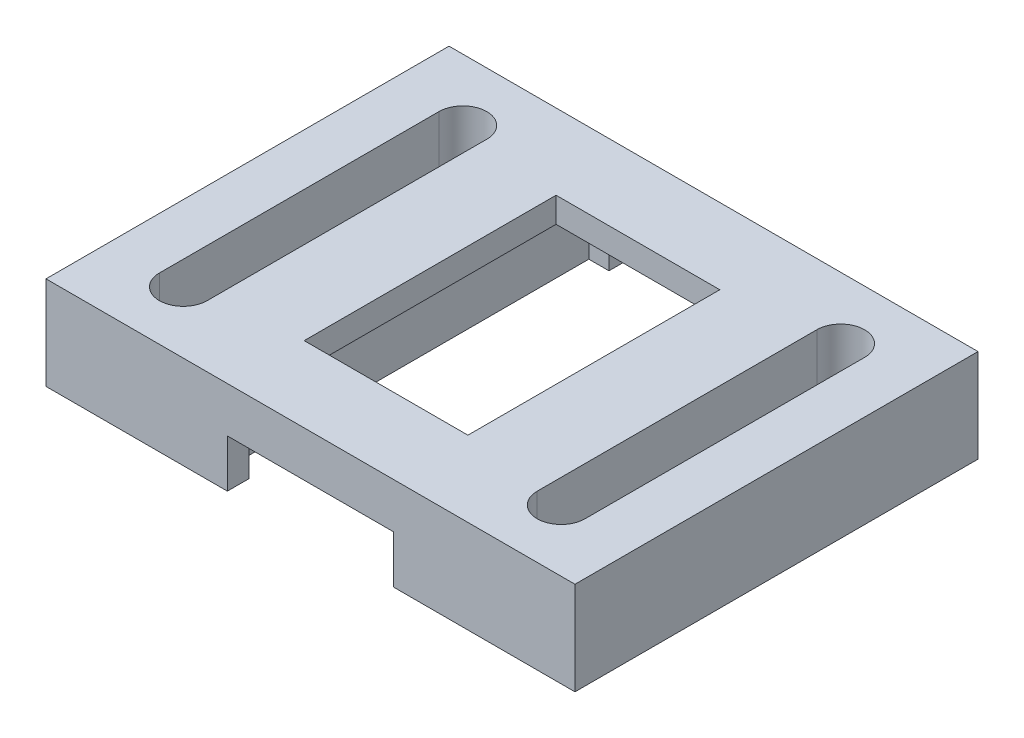
ISO-10303-21;
HEADER;
FILE_DESCRIPTION(('STEP AP214'),'2;1');
FILE_NAME('part.step','',(''),(''),'','','');
FILE_SCHEMA(('AUTOMOTIVE_DESIGN { 1 0 10303 214 1 1 1 1 }'));
ENDSEC;
DATA;
#1=APPLICATION_CONTEXT('core data for automotive mechanical design processes');
#2=APPLICATION_PROTOCOL_DEFINITION('international standard','automotive_design',2000,#1);
#3=PRODUCT_CONTEXT('',#1,'mechanical');
#4=PRODUCT('Part','Part','',(#3));
#5=PRODUCT_RELATED_PRODUCT_CATEGORY('part','',(#4));
#6=PRODUCT_DEFINITION_FORMATION('','',#4);
#7=PRODUCT_DEFINITION_CONTEXT('part definition',#1,'design');
#8=PRODUCT_DEFINITION('design','',#6,#7);
#9=PRODUCT_DEFINITION_SHAPE('','',#8);
#10=(LENGTH_UNIT() NAMED_UNIT(*) SI_UNIT(.MILLI.,.METRE.));
#11=(NAMED_UNIT(*) PLANE_ANGLE_UNIT() SI_UNIT($,.RADIAN.));
#12=(NAMED_UNIT(*) SI_UNIT($,.STERADIAN.) SOLID_ANGLE_UNIT());
#13=UNCERTAINTY_MEASURE_WITH_UNIT(LENGTH_MEASURE(1.E-05),#10,'distance_accuracy_value','');
#14=(GEOMETRIC_REPRESENTATION_CONTEXT(3) GLOBAL_UNCERTAINTY_ASSIGNED_CONTEXT((#13)) GLOBAL_UNIT_ASSIGNED_CONTEXT((#10,
#11,#12)) REPRESENTATION_CONTEXT('',''));
#15=CARTESIAN_POINT('',(0.,0.,0.));
#16=DIRECTION('',(0.,0.,1.));
#17=DIRECTION('',(1.,0.,0.));
#18=AXIS2_PLACEMENT_3D('',#15,#16,#17);
#19=CARTESIAN_POINT('',(0.,0.,0.));
#20=DIRECTION('',(0.,1.,0.));
#21=DIRECTION('',(0.,0.,1.));
#22=AXIS2_PLACEMENT_3D('',#19,#20,#21);
#23=PLANE('',#22);
#24=DIRECTION('',(1.,0.,0.));
#25=VECTOR('',#24,1.);
#26=CARTESIAN_POINT('',(-5.,0.,8.));
#27=LINE('',#26,#25);
#28=CARTESIAN_POINT('',(3.3,0.,8.));
#29=VERTEX_POINT('',#28);
#30=CARTESIAN_POINT('',(10.5,0.,8.));
#31=VERTEX_POINT('',#30);
#32=EDGE_CURVE('E426',#29,#31,#27,.T.);
#33=ORIENTED_EDGE('',*,*,#32,.F.);
#34=DIRECTION('',(0.,0.,1.));
#35=VECTOR('',#34,1.);
#36=CARTESIAN_POINT('',(3.3,0.,-8.));
#37=LINE('',#36,#35);
#38=CARTESIAN_POINT('',(3.3,0.,7.15));
#39=VERTEX_POINT('',#38);
#40=EDGE_CURVE('E345',#39,#29,#37,.T.);
#41=ORIENTED_EDGE('',*,*,#40,.F.);
#42=DIRECTION('',(-1.,0.,0.));
#43=VECTOR('',#42,1.);
#44=CARTESIAN_POINT('',(-4.1,0.,7.15));
#45=LINE('',#44,#43);
#46=CARTESIAN_POINT('',(4.1,0.,7.15));
#47=VERTEX_POINT('',#46);
#48=EDGE_CURVE('E397',#47,#39,#45,.T.);
#49=ORIENTED_EDGE('',*,*,#48,.F.);
#50=DIRECTION('',(0.,0.,1.));
#51=VECTOR('',#50,1.);
#52=CARTESIAN_POINT('',(4.1,0.,-7.15));
#53=LINE('',#52,#51);
#54=CARTESIAN_POINT('',(4.1,0.,-7.15));
#55=VERTEX_POINT('',#54);
#56=EDGE_CURVE('E380',#55,#47,#53,.T.);
#57=ORIENTED_EDGE('',*,*,#56,.F.);
#58=DIRECTION('',(1.,0.,0.));
#59=VECTOR('',#58,1.);
#60=CARTESIAN_POINT('',(-4.1,0.,-7.15));
#61=LINE('',#60,#59);
#62=CARTESIAN_POINT('',(3.3,0.,-7.15));
#63=VERTEX_POINT('',#62);
#64=EDGE_CURVE('E403',#63,#55,#61,.T.);
#65=ORIENTED_EDGE('',*,*,#64,.F.);
#66=CARTESIAN_POINT('',(3.3,0.,-8.));
#67=VERTEX_POINT('',#66);
#68=EDGE_CURVE('E342',#67,#63,#37,.T.);
#69=ORIENTED_EDGE('',*,*,#68,.F.);
#70=DIRECTION('',(-1.,0.,0.));
#71=VECTOR('',#70,1.);
#72=CARTESIAN_POINT('',(-5.,0.,-8.));
#73=LINE('',#72,#71);
#74=CARTESIAN_POINT('',(10.5,0.,-8.));
#75=VERTEX_POINT('',#74);
#76=EDGE_CURVE('E423',#75,#67,#73,.T.);
#77=ORIENTED_EDGE('',*,*,#76,.F.);
#78=DIRECTION('',(0.,0.,-1.));
#79=VECTOR('',#78,1.);
#80=CARTESIAN_POINT('',(10.5,0.,8.));
#81=LINE('',#80,#79);
#82=EDGE_CURVE('E251',#31,#75,#81,.T.);
#83=ORIENTED_EDGE('',*,*,#82,.F.);
#84=EDGE_LOOP('',(#33,#41,#49,#57,#65,#69,#77,#83));
#85=FACE_BOUND('',#84,.T.);
#86=CARTESIAN_POINT('',(7.5,0.,-5.55));
#87=DIRECTION('',(0.,-1.,0.));
#88=DIRECTION('',(0.,0.,1.));
#89=AXIS2_PLACEMENT_3D('',#86,#87,#88);
#90=CIRCLE('',#89,0.95);
#91=CARTESIAN_POINT('',(6.55,0.,-5.55));
#92=VERTEX_POINT('',#91);
#93=CARTESIAN_POINT('',(8.45,0.,-5.55));
#94=VERTEX_POINT('',#93);
#95=EDGE_CURVE('E229',#92,#94,#90,.T.);
#96=ORIENTED_EDGE('',*,*,#95,.F.);
#97=DIRECTION('',(0.,0.,-1.));
#98=VECTOR('',#97,1.);
#99=CARTESIAN_POINT('',(6.55,0.,-5.55));
#100=LINE('',#99,#98);
#101=CARTESIAN_POINT('',(6.55,0.,5.55));
#102=VERTEX_POINT('',#101);
#103=EDGE_CURVE('E221',#102,#92,#100,.T.);
#104=ORIENTED_EDGE('',*,*,#103,.F.);
#105=CARTESIAN_POINT('',(7.5,0.,5.55));
#106=DIRECTION('',(0.,-1.,0.));
#107=DIRECTION('',(0.,0.,1.));
#108=AXIS2_PLACEMENT_3D('',#105,#106,#107);
#109=CIRCLE('',#108,0.95);
#110=CARTESIAN_POINT('',(8.45,0.,5.55));
#111=VERTEX_POINT('',#110);
#112=EDGE_CURVE('E228',#111,#102,#109,.T.);
#113=ORIENTED_EDGE('',*,*,#112,.F.);
#114=DIRECTION('',(0.,0.,1.));
#115=VECTOR('',#114,1.);
#116=CARTESIAN_POINT('',(8.45,0.,-5.55));
#117=LINE('',#116,#115);
#118=EDGE_CURVE('E233',#94,#111,#117,.T.);
#119=ORIENTED_EDGE('',*,*,#118,.F.);
#120=EDGE_LOOP('',(#96,#104,#113,#119));
#121=FACE_BOUND('',#120,.T.);
#122=ADVANCED_FACE('F36',(#85,#121),#23,.F.);
#123=CARTESIAN_POINT('',(0.,3.7,0.));
#124=DIRECTION('',(0.,1.,0.));
#125=DIRECTION('',(0.,0.,1.));
#126=AXIS2_PLACEMENT_3D('',#123,#124,#125);
#127=PLANE('',#126);
#128=CARTESIAN_POINT('',(-7.5,3.7,-5.55));
#129=DIRECTION('',(0.,1.,0.));
#130=DIRECTION('',(0.,0.,1.));
#131=AXIS2_PLACEMENT_3D('',#128,#129,#130);
#132=CIRCLE('',#131,0.95);
#133=CARTESIAN_POINT('',(-6.55,3.7,-5.55));
#134=VERTEX_POINT('',#133);
#135=CARTESIAN_POINT('',(-8.45,3.7,-5.55));
#136=VERTEX_POINT('',#135);
#137=EDGE_CURVE('E264',#134,#136,#132,.T.);
#138=ORIENTED_EDGE('',*,*,#137,.F.);
#139=DIRECTION('',(0.,0.,-1.));
#140=VECTOR('',#139,1.);
#141=CARTESIAN_POINT('',(-6.55,3.7,-5.55));
#142=LINE('',#141,#140);
#143=CARTESIAN_POINT('',(-6.55,3.7,5.55));
#144=VERTEX_POINT('',#143);
#145=EDGE_CURVE('E271',#144,#134,#142,.T.);
#146=ORIENTED_EDGE('',*,*,#145,.F.);
#147=CARTESIAN_POINT('',(-7.5,3.7,5.55));
#148=DIRECTION('',(0.,1.,0.));
#149=DIRECTION('',(0.,0.,1.));
#150=AXIS2_PLACEMENT_3D('',#147,#148,#149);
#151=CIRCLE('',#150,0.95);
#152=CARTESIAN_POINT('',(-8.45,3.7,5.55));
#153=VERTEX_POINT('',#152);
#154=EDGE_CURVE('E285',#153,#144,#151,.T.);
#155=ORIENTED_EDGE('',*,*,#154,.F.);
#156=DIRECTION('',(0.,0.,1.));
#157=VECTOR('',#156,1.);
#158=CARTESIAN_POINT('',(-8.45,3.7,-5.55));
#159=LINE('',#158,#157);
#160=EDGE_CURVE('E282',#136,#153,#159,.T.);
#161=ORIENTED_EDGE('',*,*,#160,.F.);
#162=EDGE_LOOP('',(#138,#146,#155,#161));
#163=FACE_BOUND('',#162,.T.);
#164=DIRECTION('',(0.,0.,-1.));
#165=VECTOR('',#164,1.);
#166=CARTESIAN_POINT('',(3.25,3.7,5.));
#167=LINE('',#166,#165);
#168=CARTESIAN_POINT('',(3.25,3.7,5.));
#169=VERTEX_POINT('',#168);
#170=CARTESIAN_POINT('',(3.25,3.7,-5.));
#171=VERTEX_POINT('',#170);
#172=EDGE_CURVE('E318',#169,#171,#167,.T.);
#173=ORIENTED_EDGE('',*,*,#172,.F.);
#174=DIRECTION('',(1.,0.,0.));
#175=VECTOR('',#174,1.);
#176=CARTESIAN_POINT('',(-3.25,3.7,5.));
#177=LINE('',#176,#175);
#178=CARTESIAN_POINT('',(-3.25,3.7,5.));
#179=VERTEX_POINT('',#178);
#180=EDGE_CURVE('E326',#179,#169,#177,.T.);
#181=ORIENTED_EDGE('',*,*,#180,.F.);
#182=DIRECTION('',(0.,0.,1.));
#183=VECTOR('',#182,1.);
#184=CARTESIAN_POINT('',(-3.25,3.7,5.));
#185=LINE('',#184,#183);
#186=CARTESIAN_POINT('',(-3.25,3.7,-5.));
#187=VERTEX_POINT('',#186);
#188=EDGE_CURVE('E323',#187,#179,#185,.T.);
#189=ORIENTED_EDGE('',*,*,#188,.F.);
#190=DIRECTION('',(-1.,0.,0.));
#191=VECTOR('',#190,1.);
#192=CARTESIAN_POINT('',(-3.25,3.7,-5.));
#193=LINE('',#192,#191);
#194=EDGE_CURVE('E320',#171,#187,#193,.T.);
#195=ORIENTED_EDGE('',*,*,#194,.F.);
#196=EDGE_LOOP('',(#173,#181,#189,#195));
#197=FACE_BOUND('',#196,.T.);
#198=DIRECTION('',(1.,0.,0.));
#199=VECTOR('',#198,1.);
#200=CARTESIAN_POINT('',(-5.,3.7,8.));
#201=LINE('',#200,#199);
#202=CARTESIAN_POINT('',(-10.5,3.7,8.));
#203=VERTEX_POINT('',#202);
#204=CARTESIAN_POINT('',(10.5,3.7,8.));
#205=VERTEX_POINT('',#204);
#206=EDGE_CURVE('E419',#203,#205,#201,.T.);
#207=ORIENTED_EDGE('',*,*,#206,.T.);
#208=DIRECTION('',(0.,0.,-1.));
#209=VECTOR('',#208,1.);
#210=CARTESIAN_POINT('',(10.5,3.7,8.));
#211=LINE('',#210,#209);
#212=CARTESIAN_POINT('',(10.5,3.7,-8.));
#213=VERTEX_POINT('',#212);
#214=EDGE_CURVE('E255',#205,#213,#211,.T.);
#215=ORIENTED_EDGE('',*,*,#214,.T.);
#216=DIRECTION('',(-1.,0.,0.));
#217=VECTOR('',#216,1.);
#218=CARTESIAN_POINT('',(-5.,3.7,-8.));
#219=LINE('',#218,#217);
#220=CARTESIAN_POINT('',(-10.5,3.7,-8.));
#221=VERTEX_POINT('',#220);
#222=EDGE_CURVE('E417',#213,#221,#219,.T.);
#223=ORIENTED_EDGE('',*,*,#222,.T.);
#224=DIRECTION('',(0.,0.,-1.));
#225=VECTOR('',#224,1.);
#226=CARTESIAN_POINT('',(-10.5,3.7,8.));
#227=LINE('',#226,#225);
#228=EDGE_CURVE('E299',#203,#221,#227,.T.);
#229=ORIENTED_EDGE('',*,*,#228,.F.);
#230=EDGE_LOOP('',(#207,#215,#223,#229));
#231=FACE_BOUND('',#230,.T.);
#232=DIRECTION('',(0.,0.,-1.));
#233=VECTOR('',#232,1.);
#234=CARTESIAN_POINT('',(6.55,3.7,-5.55));
#235=LINE('',#234,#233);
#236=CARTESIAN_POINT('',(6.55,3.7,5.55));
#237=VERTEX_POINT('',#236);
#238=CARTESIAN_POINT('',(6.55,3.7,-5.55));
#239=VERTEX_POINT('',#238);
#240=EDGE_CURVE('E245',#237,#239,#235,.T.);
#241=ORIENTED_EDGE('',*,*,#240,.T.);
#242=CARTESIAN_POINT('',(7.5,3.7,-5.55));
#243=DIRECTION('',(0.,-1.,0.));
#244=DIRECTION('',(0.,0.,1.));
#245=AXIS2_PLACEMENT_3D('',#242,#243,#244);
#246=CIRCLE('',#245,0.95);
#247=CARTESIAN_POINT('',(8.45,3.7,-5.55));
#248=VERTEX_POINT('',#247);
#249=EDGE_CURVE('E59',#239,#248,#246,.T.);
#250=ORIENTED_EDGE('',*,*,#249,.T.);
#251=DIRECTION('',(0.,0.,1.));
#252=VECTOR('',#251,1.);
#253=CARTESIAN_POINT('',(8.45,3.7,-5.55));
#254=LINE('',#253,#252);
#255=CARTESIAN_POINT('',(8.45,3.7,5.55));
#256=VERTEX_POINT('',#255);
#257=EDGE_CURVE('E236',#248,#256,#254,.T.);
#258=ORIENTED_EDGE('',*,*,#257,.T.);
#259=CARTESIAN_POINT('',(7.5,3.7,5.55));
#260=DIRECTION('',(0.,-1.,0.));
#261=DIRECTION('',(0.,0.,1.));
#262=AXIS2_PLACEMENT_3D('',#259,#260,#261);
#263=CIRCLE('',#262,0.95);
#264=EDGE_CURVE('E239',#256,#237,#263,.T.);
#265=ORIENTED_EDGE('',*,*,#264,.T.);
#266=EDGE_LOOP('',(#241,#250,#258,#265));
#267=FACE_BOUND('',#266,.T.);
#268=ADVANCED_FACE('F475',(#163,#197,#231,#267),#127,.T.);
#269=CARTESIAN_POINT('',(0.,2.7,0.));
#270=DIRECTION('',(0.,1.,0.));
#271=DIRECTION('',(0.,0.,1.));
#272=AXIS2_PLACEMENT_3D('',#269,#270,#271);
#273=PLANE('',#272);
#274=DIRECTION('',(0.,0.,1.));
#275=VECTOR('',#274,1.);
#276=CARTESIAN_POINT('',(4.1,2.7,-7.15));
#277=LINE('',#276,#275);
#278=CARTESIAN_POINT('',(4.1,2.7,-7.15));
#279=VERTEX_POINT('',#278);
#280=CARTESIAN_POINT('',(4.1,2.7,7.15));
#281=VERTEX_POINT('',#280);
#282=EDGE_CURVE('E381',#279,#281,#277,.T.);
#283=ORIENTED_EDGE('',*,*,#282,.T.);
#284=DIRECTION('',(-1.,0.,0.));
#285=VECTOR('',#284,1.);
#286=CARTESIAN_POINT('',(-4.1,2.7,7.15));
#287=LINE('',#286,#285);
#288=CARTESIAN_POINT('',(-4.1,2.7,7.15));
#289=VERTEX_POINT('',#288);
#290=EDGE_CURVE('E384',#281,#289,#287,.T.);
#291=ORIENTED_EDGE('',*,*,#290,.T.);
#292=DIRECTION('',(0.,0.,-1.));
#293=VECTOR('',#292,1.);
#294=CARTESIAN_POINT('',(-4.1,2.7,-7.15));
#295=LINE('',#294,#293);
#296=CARTESIAN_POINT('',(-4.1,2.7,-7.15));
#297=VERTEX_POINT('',#296);
#298=EDGE_CURVE('E388',#289,#297,#295,.T.);
#299=ORIENTED_EDGE('',*,*,#298,.T.);
#300=DIRECTION('',(1.,0.,0.));
#301=VECTOR('',#300,1.);
#302=CARTESIAN_POINT('',(-4.1,2.7,-7.15));
#303=LINE('',#302,#301);
#304=EDGE_CURVE('E391',#297,#279,#303,.T.);
#305=ORIENTED_EDGE('',*,*,#304,.T.);
#306=EDGE_LOOP('',(#283,#291,#299,#305));
#307=FACE_BOUND('',#306,.T.);
#308=DIRECTION('',(1.,0.,0.));
#309=VECTOR('',#308,1.);
#310=CARTESIAN_POINT('',(-3.25,2.7,-5.));
#311=LINE('',#310,#309);
#312=CARTESIAN_POINT('',(-3.25,2.7,-5.));
#313=VERTEX_POINT('',#312);
#314=CARTESIAN_POINT('',(3.25,2.7,-5.));
#315=VERTEX_POINT('',#314);
#316=EDGE_CURVE('E332',#313,#315,#311,.T.);
#317=ORIENTED_EDGE('',*,*,#316,.F.);
#318=DIRECTION('',(0.,0.,-1.));
#319=VECTOR('',#318,1.);
#320=CARTESIAN_POINT('',(-3.25,2.7,5.));
#321=LINE('',#320,#319);
#322=CARTESIAN_POINT('',(-3.25,2.7,5.));
#323=VERTEX_POINT('',#322);
#324=EDGE_CURVE('E308',#323,#313,#321,.T.);
#325=ORIENTED_EDGE('',*,*,#324,.F.);
#326=DIRECTION('',(-1.,0.,0.));
#327=VECTOR('',#326,1.);
#328=CARTESIAN_POINT('',(-3.25,2.7,5.));
#329=LINE('',#328,#327);
#330=CARTESIAN_POINT('',(3.25,2.7,5.));
#331=VERTEX_POINT('',#330);
#332=EDGE_CURVE('E313',#331,#323,#329,.T.);
#333=ORIENTED_EDGE('',*,*,#332,.F.);
#334=DIRECTION('',(0.,0.,1.));
#335=VECTOR('',#334,1.);
#336=CARTESIAN_POINT('',(3.25,2.7,5.));
#337=LINE('',#336,#335);
#338=EDGE_CURVE('E315',#315,#331,#337,.T.);
#339=ORIENTED_EDGE('',*,*,#338,.F.);
#340=EDGE_LOOP('',(#317,#325,#333,#339));
#341=FACE_BOUND('',#340,.T.);
#342=ADVANCED_FACE('F460',(#307,#341),#273,.F.);
#343=CARTESIAN_POINT('',(-5.,3.7,-8.));
#344=DIRECTION('',(0.,0.,1.));
#345=DIRECTION('',(1.,0.,0.));
#346=AXIS2_PLACEMENT_3D('',#343,#344,#345);
#347=PLANE('',#346);
#348=ORIENTED_EDGE('',*,*,#76,.T.);
#349=DIRECTION('',(0.,-1.,0.));
#350=VECTOR('',#349,1.);
#351=CARTESIAN_POINT('',(3.3,20.0078017090559,-8.));
#352=LINE('',#351,#350);
#353=CARTESIAN_POINT('',(3.3,1.9,-8.));
#354=VERTEX_POINT('',#353);
#355=EDGE_CURVE('E350',#354,#67,#352,.T.);
#356=ORIENTED_EDGE('',*,*,#355,.F.);
#357=DIRECTION('',(1.,0.,0.));
#358=VECTOR('',#357,1.);
#359=CARTESIAN_POINT('',(3.3,1.9,-8.));
#360=LINE('',#359,#358);
#361=CARTESIAN_POINT('',(-3.3,1.9,-8.));
#362=VERTEX_POINT('',#361);
#363=EDGE_CURVE('E344',#362,#354,#360,.T.);
#364=ORIENTED_EDGE('',*,*,#363,.F.);
#365=DIRECTION('',(0.,-1.,0.));
#366=VECTOR('',#365,1.);
#367=CARTESIAN_POINT('',(-3.3,20.0078017090559,-8.));
#368=LINE('',#367,#366);
#369=CARTESIAN_POINT('',(-3.3,0.,-8.));
#370=VERTEX_POINT('',#369);
#371=EDGE_CURVE('E354',#362,#370,#368,.T.);
#372=ORIENTED_EDGE('',*,*,#371,.T.);
#373=CARTESIAN_POINT('',(-10.5,0.,-8.));
#374=VERTEX_POINT('',#373);
#375=EDGE_CURVE('E409',#370,#374,#73,.T.);
#376=ORIENTED_EDGE('',*,*,#375,.T.);
#377=DIRECTION('',(0.,-1.,0.));
#378=VECTOR('',#377,1.);
#379=CARTESIAN_POINT('',(-10.5,3.7,-8.));
#380=LINE('',#379,#378);
#381=EDGE_CURVE('E302',#221,#374,#380,.T.);
#382=ORIENTED_EDGE('',*,*,#381,.F.);
#383=ORIENTED_EDGE('',*,*,#222,.F.);
#384=DIRECTION('',(0.,-1.,0.));
#385=VECTOR('',#384,1.);
#386=CARTESIAN_POINT('',(10.5,3.7,-8.));
#387=LINE('',#386,#385);
#388=EDGE_CURVE('E261',#213,#75,#387,.T.);
#389=ORIENTED_EDGE('',*,*,#388,.T.);
#390=EDGE_LOOP('',(#348,#356,#364,#372,#376,#382,#383,#389));
#391=FACE_BOUND('',#390,.T.);
#392=ADVANCED_FACE('F38',(#391),#347,.F.);
#393=CARTESIAN_POINT('',(-5.,3.7,8.));
#394=DIRECTION('',(0.,0.,-1.));
#395=DIRECTION('',(-1.,0.,0.));
#396=AXIS2_PLACEMENT_3D('',#393,#394,#395);
#397=PLANE('',#396);
#398=DIRECTION('',(-1.,0.,0.));
#399=VECTOR('',#398,1.);
#400=CARTESIAN_POINT('',(3.3,1.9,8.));
#401=LINE('',#400,#399);
#402=CARTESIAN_POINT('',(3.3,1.9,7.99999999999999));
#403=VERTEX_POINT('',#402);
#404=CARTESIAN_POINT('',(-3.3,1.9,8.));
#405=VERTEX_POINT('',#404);
#406=EDGE_CURVE('E356',#403,#405,#401,.T.);
#407=ORIENTED_EDGE('',*,*,#406,.F.);
#408=DIRECTION('',(0.,-1.,0.));
#409=VECTOR('',#408,1.);
#410=CARTESIAN_POINT('',(3.3,20.0078017090559,8.));
#411=LINE('',#410,#409);
#412=EDGE_CURVE('E360',#403,#29,#411,.T.);
#413=ORIENTED_EDGE('',*,*,#412,.T.);
#414=ORIENTED_EDGE('',*,*,#32,.T.);
#415=DIRECTION('',(0.,-1.,0.));
#416=VECTOR('',#415,1.);
#417=CARTESIAN_POINT('',(10.5,3.7,8.));
#418=LINE('',#417,#416);
#419=EDGE_CURVE('E258',#205,#31,#418,.T.);
#420=ORIENTED_EDGE('',*,*,#419,.F.);
#421=ORIENTED_EDGE('',*,*,#206,.F.);
#422=DIRECTION('',(0.,-1.,0.));
#423=VECTOR('',#422,1.);
#424=CARTESIAN_POINT('',(-10.5,3.7,8.));
#425=LINE('',#424,#423);
#426=CARTESIAN_POINT('',(-10.5,0.,8.));
#427=VERTEX_POINT('',#426);
#428=EDGE_CURVE('E305',#203,#427,#425,.T.);
#429=ORIENTED_EDGE('',*,*,#428,.T.);
#430=CARTESIAN_POINT('',(-3.3,0.,8.));
#431=VERTEX_POINT('',#430);
#432=EDGE_CURVE('E420',#427,#431,#27,.T.);
#433=ORIENTED_EDGE('',*,*,#432,.T.);
#434=DIRECTION('',(0.,-1.,0.));
#435=VECTOR('',#434,1.);
#436=CARTESIAN_POINT('',(-3.3,20.0078017090559,8.));
#437=LINE('',#436,#435);
#438=EDGE_CURVE('E359',#405,#431,#437,.T.);
#439=ORIENTED_EDGE('',*,*,#438,.F.);
#440=EDGE_LOOP('',(#407,#413,#414,#420,#421,#429,#433,#439));
#441=FACE_BOUND('',#440,.T.);
#442=ADVANCED_FACE('F445',(#441),#397,.F.);
#443=DIRECTION('',(0.,0.,-1.));
#444=VECTOR('',#443,1.);
#445=CARTESIAN_POINT('',(-6.55,0.,-5.55));
#446=LINE('',#445,#444);
#447=CARTESIAN_POINT('',(-6.55,0.,5.55));
#448=VERTEX_POINT('',#447);
#449=CARTESIAN_POINT('',(-6.55,0.,-5.55));
#450=VERTEX_POINT('',#449);
#451=EDGE_CURVE('E277',#448,#450,#446,.T.);
#452=ORIENTED_EDGE('',*,*,#451,.T.);
#453=CARTESIAN_POINT('',(-7.5,0.,-5.55));
#454=DIRECTION('',(0.,1.,0.));
#455=DIRECTION('',(0.,0.,1.));
#456=AXIS2_PLACEMENT_3D('',#453,#454,#455);
#457=CIRCLE('',#456,0.95);
#458=CARTESIAN_POINT('',(-8.45,0.,-5.55));
#459=VERTEX_POINT('',#458);
#460=EDGE_CURVE('E267',#450,#459,#457,.T.);
#461=ORIENTED_EDGE('',*,*,#460,.T.);
#462=DIRECTION('',(0.,0.,1.));
#463=VECTOR('',#462,1.);
#464=CARTESIAN_POINT('',(-8.45,0.,-5.55));
#465=LINE('',#464,#463);
#466=CARTESIAN_POINT('',(-8.45,0.,5.55));
#467=VERTEX_POINT('',#466);
#468=EDGE_CURVE('E270',#459,#467,#465,.T.);
#469=ORIENTED_EDGE('',*,*,#468,.T.);
#470=CARTESIAN_POINT('',(-7.5,0.,5.55));
#471=DIRECTION('',(0.,1.,0.));
#472=DIRECTION('',(0.,0.,1.));
#473=AXIS2_PLACEMENT_3D('',#470,#471,#472);
#474=CIRCLE('',#473,0.95);
#475=EDGE_CURVE('E274',#467,#448,#474,.T.);
#476=ORIENTED_EDGE('',*,*,#475,.T.);
#477=EDGE_LOOP('',(#452,#461,#469,#476));
#478=FACE_BOUND('',#477,.T.);
#479=ORIENTED_EDGE('',*,*,#375,.F.);
#480=DIRECTION('',(0.,0.,-1.));
#481=VECTOR('',#480,1.);
#482=CARTESIAN_POINT('',(-3.3,0.,-8.));
#483=LINE('',#482,#481);
#484=CARTESIAN_POINT('',(-3.3,0.,-7.15));
#485=VERTEX_POINT('',#484);
#486=EDGE_CURVE('E341',#485,#370,#483,.T.);
#487=ORIENTED_EDGE('',*,*,#486,.F.);
#488=CARTESIAN_POINT('',(-4.1,0.,-7.15));
#489=VERTEX_POINT('',#488);
#490=EDGE_CURVE('E385',#489,#485,#61,.T.);
#491=ORIENTED_EDGE('',*,*,#490,.F.);
#492=DIRECTION('',(0.,0.,-1.));
#493=VECTOR('',#492,1.);
#494=CARTESIAN_POINT('',(-4.1,0.,-7.15));
#495=LINE('',#494,#493);
#496=CARTESIAN_POINT('',(-4.1,0.,7.15));
#497=VERTEX_POINT('',#496);
#498=EDGE_CURVE('E400',#497,#489,#495,.T.);
#499=ORIENTED_EDGE('',*,*,#498,.F.);
#500=CARTESIAN_POINT('',(-3.3,0.,7.15));
#501=VERTEX_POINT('',#500);
#502=EDGE_CURVE('E396',#501,#497,#45,.T.);
#503=ORIENTED_EDGE('',*,*,#502,.F.);
#504=EDGE_CURVE('E346',#431,#501,#483,.T.);
#505=ORIENTED_EDGE('',*,*,#504,.F.);
#506=ORIENTED_EDGE('',*,*,#432,.F.);
#507=DIRECTION('',(0.,0.,-1.));
#508=VECTOR('',#507,1.);
#509=CARTESIAN_POINT('',(-10.5,0.,8.));
#510=LINE('',#509,#508);
#511=EDGE_CURVE('E292',#427,#374,#510,.T.);
#512=ORIENTED_EDGE('',*,*,#511,.T.);
#513=EDGE_LOOP('',(#479,#487,#491,#499,#503,#505,#506,#512));
#514=FACE_BOUND('',#513,.T.);
#515=ADVANCED_FACE('F451',(#478,#514),#23,.F.);
#516=CARTESIAN_POINT('',(4.1,2.7,-7.15));
#517=DIRECTION('',(1.,0.,0.));
#518=DIRECTION('',(0.,0.,-1.));
#519=AXIS2_PLACEMENT_3D('',#516,#517,#518);
#520=PLANE('',#519);
#521=ORIENTED_EDGE('',*,*,#56,.T.);
#522=DIRECTION('',(0.,-1.,0.));
#523=VECTOR('',#522,1.);
#524=CARTESIAN_POINT('',(4.1,2.7,7.15));
#525=LINE('',#524,#523);
#526=EDGE_CURVE('E394',#281,#47,#525,.T.);
#527=ORIENTED_EDGE('',*,*,#526,.F.);
#528=ORIENTED_EDGE('',*,*,#282,.F.);
#529=DIRECTION('',(0.,-1.,0.));
#530=VECTOR('',#529,1.);
#531=CARTESIAN_POINT('',(4.1,2.7,-7.15));
#532=LINE('',#531,#530);
#533=EDGE_CURVE('E406',#279,#55,#532,.T.);
#534=ORIENTED_EDGE('',*,*,#533,.T.);
#535=EDGE_LOOP('',(#521,#527,#528,#534));
#536=FACE_BOUND('',#535,.T.);
#537=ADVANCED_FACE('F493',(#536),#520,.F.);
#538=CARTESIAN_POINT('',(-4.1,2.7,-7.15));
#539=DIRECTION('',(0.,0.,-1.));
#540=DIRECTION('',(-1.,0.,0.));
#541=AXIS2_PLACEMENT_3D('',#538,#539,#540);
#542=PLANE('',#541);
#543=DIRECTION('',(1.,0.,0.));
#544=VECTOR('',#543,1.);
#545=CARTESIAN_POINT('',(-4.1,1.9,-7.15));
#546=LINE('',#545,#544);
#547=CARTESIAN_POINT('',(-3.3,1.9,-7.15));
#548=VERTEX_POINT('',#547);
#549=CARTESIAN_POINT('',(3.3,1.9,-7.15));
#550=VERTEX_POINT('',#549);
#551=EDGE_CURVE('E377',#548,#550,#546,.T.);
#552=ORIENTED_EDGE('',*,*,#551,.T.);
#553=DIRECTION('',(0.,-1.,0.));
#554=VECTOR('',#553,1.);
#555=CARTESIAN_POINT('',(3.3,2.7,-7.15));
#556=LINE('',#555,#554);
#557=EDGE_CURVE('E374',#550,#63,#556,.T.);
#558=ORIENTED_EDGE('',*,*,#557,.T.);
#559=ORIENTED_EDGE('',*,*,#64,.T.);
#560=ORIENTED_EDGE('',*,*,#533,.F.);
#561=ORIENTED_EDGE('',*,*,#304,.F.);
#562=DIRECTION('',(0.,-1.,0.));
#563=VECTOR('',#562,1.);
#564=CARTESIAN_POINT('',(-4.1,2.7,-7.15));
#565=LINE('',#564,#563);
#566=EDGE_CURVE('E410',#297,#489,#565,.T.);
#567=ORIENTED_EDGE('',*,*,#566,.T.);
#568=ORIENTED_EDGE('',*,*,#490,.T.);
#569=DIRECTION('',(0.,1.,0.));
#570=VECTOR('',#569,1.);
#571=CARTESIAN_POINT('',(-3.3,2.7,-7.15));
#572=LINE('',#571,#570);
#573=EDGE_CURVE('E371',#485,#548,#572,.T.);
#574=ORIENTED_EDGE('',*,*,#573,.T.);
#575=EDGE_LOOP('',(#552,#558,#559,#560,#561,#567,#568,#574));
#576=FACE_BOUND('',#575,.T.);
#577=ADVANCED_FACE('F492',(#576),#542,.F.);
#578=CARTESIAN_POINT('',(-4.1,2.7,-7.15));
#579=DIRECTION('',(-1.,0.,0.));
#580=DIRECTION('',(0.,0.,1.));
#581=AXIS2_PLACEMENT_3D('',#578,#579,#580);
#582=PLANE('',#581);
#583=ORIENTED_EDGE('',*,*,#498,.T.);
#584=ORIENTED_EDGE('',*,*,#566,.F.);
#585=ORIENTED_EDGE('',*,*,#298,.F.);
#586=DIRECTION('',(0.,-1.,0.));
#587=VECTOR('',#586,1.);
#588=CARTESIAN_POINT('',(-4.1,2.7,7.15));
#589=LINE('',#588,#587);
#590=EDGE_CURVE('E412',#289,#497,#589,.T.);
#591=ORIENTED_EDGE('',*,*,#590,.T.);
#592=EDGE_LOOP('',(#583,#584,#585,#591));
#593=FACE_BOUND('',#592,.T.);
#594=ADVANCED_FACE('F457',(#593),#582,.F.);
#595=CARTESIAN_POINT('',(-4.1,2.7,7.15));
#596=DIRECTION('',(0.,0.,1.));
#597=DIRECTION('',(1.,0.,0.));
#598=AXIS2_PLACEMENT_3D('',#595,#596,#597);
#599=PLANE('',#598);
#600=ORIENTED_EDGE('',*,*,#48,.T.);
#601=DIRECTION('',(0.,1.,0.));
#602=VECTOR('',#601,1.);
#603=CARTESIAN_POINT('',(3.3,2.7,7.15));
#604=LINE('',#603,#602);
#605=CARTESIAN_POINT('',(3.3,1.9,7.15));
#606=VERTEX_POINT('',#605);
#607=EDGE_CURVE('E13',#39,#606,#604,.T.);
#608=ORIENTED_EDGE('',*,*,#607,.T.);
#609=DIRECTION('',(-1.,0.,0.));
#610=VECTOR('',#609,1.);
#611=CARTESIAN_POINT('',(-4.1,1.9,7.15));
#612=LINE('',#611,#610);
#613=CARTESIAN_POINT('',(-3.3,1.9,7.15));
#614=VERTEX_POINT('',#613);
#615=EDGE_CURVE('E44',#606,#614,#612,.T.);
#616=ORIENTED_EDGE('',*,*,#615,.T.);
#617=DIRECTION('',(0.,-1.,0.));
#618=VECTOR('',#617,1.);
#619=CARTESIAN_POINT('',(-3.3,2.7,7.15));
#620=LINE('',#619,#618);
#621=EDGE_CURVE('E422',#614,#501,#620,.T.);
#622=ORIENTED_EDGE('',*,*,#621,.T.);
#623=ORIENTED_EDGE('',*,*,#502,.T.);
#624=ORIENTED_EDGE('',*,*,#590,.F.);
#625=ORIENTED_EDGE('',*,*,#290,.F.);
#626=ORIENTED_EDGE('',*,*,#526,.T.);
#627=EDGE_LOOP('',(#600,#608,#616,#622,#623,#624,#625,#626));
#628=FACE_BOUND('',#627,.T.);
#629=ADVANCED_FACE('F432',(#628),#599,.F.);
#630=CARTESIAN_POINT('',(-3.3,20.0078017090559,-8.));
#631=DIRECTION('',(-1.,0.,0.));
#632=DIRECTION('',(0.,0.,1.));
#633=AXIS2_PLACEMENT_3D('',#630,#631,#632);
#634=PLANE('',#633);
#635=DIRECTION('',(0.,0.,-1.));
#636=VECTOR('',#635,1.);
#637=CARTESIAN_POINT('',(-3.3,1.9,-8.));
#638=LINE('',#637,#636);
#639=EDGE_CURVE('E351',#405,#614,#638,.T.);
#640=ORIENTED_EDGE('',*,*,#639,.F.);
#641=ORIENTED_EDGE('',*,*,#438,.T.);
#642=ORIENTED_EDGE('',*,*,#504,.T.);
#643=ORIENTED_EDGE('',*,*,#621,.F.);
#644=EDGE_LOOP('',(#640,#641,#642,#643));
#645=FACE_BOUND('',#644,.T.);
#646=ADVANCED_FACE('F448',(#645),#634,.F.);
#647=CARTESIAN_POINT('',(3.3,20.0078017090559,-8.));
#648=DIRECTION('',(1.,0.,0.));
#649=DIRECTION('',(0.,0.,-1.));
#650=AXIS2_PLACEMENT_3D('',#647,#648,#649);
#651=PLANE('',#650);
#652=ORIENTED_EDGE('',*,*,#40,.T.);
#653=ORIENTED_EDGE('',*,*,#412,.F.);
#654=DIRECTION('',(0.,0.,1.));
#655=VECTOR('',#654,1.);
#656=CARTESIAN_POINT('',(3.3,1.9,-8.));
#657=LINE('',#656,#655);
#658=EDGE_CURVE('E364',#606,#403,#657,.T.);
#659=ORIENTED_EDGE('',*,*,#658,.F.);
#660=ORIENTED_EDGE('',*,*,#607,.F.);
#661=EDGE_LOOP('',(#652,#653,#659,#660));
#662=FACE_BOUND('',#661,.T.);
#663=ADVANCED_FACE('F439',(#662),#651,.F.);
#664=CARTESIAN_POINT('',(0.,1.9,0.));
#665=DIRECTION('',(0.,1.,0.));
#666=DIRECTION('',(0.,0.,1.));
#667=AXIS2_PLACEMENT_3D('',#664,#665,#666);
#668=PLANE('',#667);
#669=ORIENTED_EDGE('',*,*,#658,.T.);
#670=ORIENTED_EDGE('',*,*,#406,.T.);
#671=ORIENTED_EDGE('',*,*,#639,.T.);
#672=ORIENTED_EDGE('',*,*,#615,.F.);
#673=EDGE_LOOP('',(#669,#670,#671,#672));
#674=FACE_BOUND('',#673,.T.);
#675=ADVANCED_FACE('F436',(#674),#668,.F.);
#676=EDGE_CURVE('E355',#548,#362,#638,.T.);
#677=ORIENTED_EDGE('',*,*,#676,.T.);
#678=ORIENTED_EDGE('',*,*,#363,.T.);
#679=EDGE_CURVE('E361',#354,#550,#657,.T.);
#680=ORIENTED_EDGE('',*,*,#679,.T.);
#681=ORIENTED_EDGE('',*,*,#551,.F.);
#682=EDGE_LOOP('',(#677,#678,#680,#681));
#683=FACE_BOUND('',#682,.T.);
#684=ADVANCED_FACE('F521',(#683),#668,.F.);
#685=ORIENTED_EDGE('',*,*,#679,.F.);
#686=ORIENTED_EDGE('',*,*,#355,.T.);
#687=ORIENTED_EDGE('',*,*,#68,.T.);
#688=ORIENTED_EDGE('',*,*,#557,.F.);
#689=EDGE_LOOP('',(#685,#686,#687,#688));
#690=FACE_BOUND('',#689,.T.);
#691=ADVANCED_FACE('F533',(#690),#651,.F.);
#692=ORIENTED_EDGE('',*,*,#486,.T.);
#693=ORIENTED_EDGE('',*,*,#371,.F.);
#694=ORIENTED_EDGE('',*,*,#676,.F.);
#695=ORIENTED_EDGE('',*,*,#573,.F.);
#696=EDGE_LOOP('',(#692,#693,#694,#695));
#697=FACE_BOUND('',#696,.T.);
#698=ADVANCED_FACE('F489',(#697),#634,.F.);
#699=CARTESIAN_POINT('',(3.25,-0.00100000000000013,5.));
#700=DIRECTION('',(1.,0.,0.));
#701=DIRECTION('',(0.,0.,-1.));
#702=AXIS2_PLACEMENT_3D('',#699,#700,#701);
#703=PLANE('',#702);
#704=ORIENTED_EDGE('',*,*,#338,.T.);
#705=DIRECTION('',(0.,1.,0.));
#706=VECTOR('',#705,1.);
#707=CARTESIAN_POINT('',(3.25,-0.00100000000000013,5.));
#708=LINE('',#707,#706);
#709=EDGE_CURVE('E330',#331,#169,#708,.T.);
#710=ORIENTED_EDGE('',*,*,#709,.T.);
#711=ORIENTED_EDGE('',*,*,#172,.T.);
#712=DIRECTION('',(0.,1.,0.));
#713=VECTOR('',#712,1.);
#714=CARTESIAN_POINT('',(3.25,-0.00100000000000013,-5.));
#715=LINE('',#714,#713);
#716=EDGE_CURVE('E329',#315,#171,#715,.T.);
#717=ORIENTED_EDGE('',*,*,#716,.F.);
#718=EDGE_LOOP('',(#704,#710,#711,#717));
#719=FACE_BOUND('',#718,.T.);
#720=ADVANCED_FACE('F536',(#719),#703,.F.);
#721=CARTESIAN_POINT('',(-3.25,-0.00100000000000013,5.));
#722=DIRECTION('',(0.,0.,1.));
#723=DIRECTION('',(1.,0.,0.));
#724=AXIS2_PLACEMENT_3D('',#721,#722,#723);
#725=PLANE('',#724);
#726=ORIENTED_EDGE('',*,*,#332,.T.);
#727=DIRECTION('',(0.,1.,0.));
#728=VECTOR('',#727,1.);
#729=CARTESIAN_POINT('',(-3.25,-0.00100000000000013,5.));
#730=LINE('',#729,#728);
#731=EDGE_CURVE('E333',#323,#179,#730,.T.);
#732=ORIENTED_EDGE('',*,*,#731,.T.);
#733=ORIENTED_EDGE('',*,*,#180,.T.);
#734=ORIENTED_EDGE('',*,*,#709,.F.);
#735=EDGE_LOOP('',(#726,#732,#733,#734));
#736=FACE_BOUND('',#735,.T.);
#737=ADVANCED_FACE('F541',(#736),#725,.F.);
#738=CARTESIAN_POINT('',(-3.25,-0.00100000000000013,5.));
#739=DIRECTION('',(-1.,0.,0.));
#740=DIRECTION('',(0.,0.,1.));
#741=AXIS2_PLACEMENT_3D('',#738,#739,#740);
#742=PLANE('',#741);
#743=ORIENTED_EDGE('',*,*,#324,.T.);
#744=DIRECTION('',(0.,1.,0.));
#745=VECTOR('',#744,1.);
#746=CARTESIAN_POINT('',(-3.25,-0.00100000000000013,-5.));
#747=LINE('',#746,#745);
#748=EDGE_CURVE('E335',#313,#187,#747,.T.);
#749=ORIENTED_EDGE('',*,*,#748,.T.);
#750=ORIENTED_EDGE('',*,*,#188,.T.);
#751=ORIENTED_EDGE('',*,*,#731,.F.);
#752=EDGE_LOOP('',(#743,#749,#750,#751));
#753=FACE_BOUND('',#752,.T.);
#754=ADVANCED_FACE('F618',(#753),#742,.F.);
#755=CARTESIAN_POINT('',(-3.25,-0.00100000000000013,-5.));
#756=DIRECTION('',(0.,0.,-1.));
#757=DIRECTION('',(-1.,0.,0.));
#758=AXIS2_PLACEMENT_3D('',#755,#756,#757);
#759=PLANE('',#758);
#760=ORIENTED_EDGE('',*,*,#316,.T.);
#761=ORIENTED_EDGE('',*,*,#716,.T.);
#762=ORIENTED_EDGE('',*,*,#194,.T.);
#763=ORIENTED_EDGE('',*,*,#748,.F.);
#764=EDGE_LOOP('',(#760,#761,#762,#763));
#765=FACE_BOUND('',#764,.T.);
#766=ADVANCED_FACE('F612',(#765),#759,.F.);
#767=CARTESIAN_POINT('',(-10.5,3.7,8.));
#768=DIRECTION('',(-1.,0.,0.));
#769=DIRECTION('',(0.,0.,1.));
#770=AXIS2_PLACEMENT_3D('',#767,#768,#769);
#771=PLANE('',#770);
#772=ORIENTED_EDGE('',*,*,#511,.F.);
#773=ORIENTED_EDGE('',*,*,#428,.F.);
#774=ORIENTED_EDGE('',*,*,#228,.T.);
#775=ORIENTED_EDGE('',*,*,#381,.T.);
#776=EDGE_LOOP('',(#772,#773,#774,#775));
#777=FACE_BOUND('',#776,.T.);
#778=ADVANCED_FACE('F482',(#777),#771,.T.);
#779=CARTESIAN_POINT('',(-7.5,0.,-5.55));
#780=DIRECTION('',(0.,1.,0.));
#781=DIRECTION('',(0.,0.,1.));
#782=AXIS2_PLACEMENT_3D('',#779,#780,#781);
#783=CYLINDRICAL_SURFACE('',#782,0.95);
#784=ORIENTED_EDGE('',*,*,#137,.T.);
#785=DIRECTION('',(0.,1.,0.));
#786=VECTOR('',#785,1.);
#787=CARTESIAN_POINT('',(-8.45,0.,-5.55));
#788=LINE('',#787,#786);
#789=EDGE_CURVE('E280',#459,#136,#788,.T.);
#790=ORIENTED_EDGE('',*,*,#789,.F.);
#791=ORIENTED_EDGE('',*,*,#460,.F.);
#792=DIRECTION('',(0.,1.,0.));
#793=VECTOR('',#792,1.);
#794=CARTESIAN_POINT('',(-6.55,0.,-5.55));
#795=LINE('',#794,#793);
#796=EDGE_CURVE('E290',#450,#134,#795,.T.);
#797=ORIENTED_EDGE('',*,*,#796,.T.);
#798=EDGE_LOOP('',(#784,#790,#791,#797));
#799=FACE_BOUND('',#798,.T.);
#800=ADVANCED_FACE('F668',(#799),#783,.F.);
#801=CARTESIAN_POINT('',(-6.55,0.,-5.55));
#802=DIRECTION('',(1.,0.,0.));
#803=DIRECTION('',(0.,0.,-1.));
#804=AXIS2_PLACEMENT_3D('',#801,#802,#803);
#805=PLANE('',#804);
#806=ORIENTED_EDGE('',*,*,#145,.T.);
#807=ORIENTED_EDGE('',*,*,#796,.F.);
#808=ORIENTED_EDGE('',*,*,#451,.F.);
#809=DIRECTION('',(0.,1.,0.));
#810=VECTOR('',#809,1.);
#811=CARTESIAN_POINT('',(-6.55,0.,5.55));
#812=LINE('',#811,#810);
#813=EDGE_CURVE('E293',#448,#144,#812,.T.);
#814=ORIENTED_EDGE('',*,*,#813,.T.);
#815=EDGE_LOOP('',(#806,#807,#808,#814));
#816=FACE_BOUND('',#815,.T.);
#817=ADVANCED_FACE('F674',(#816),#805,.F.);
#818=CARTESIAN_POINT('',(-7.5,0.,5.55));
#819=DIRECTION('',(0.,1.,0.));
#820=DIRECTION('',(0.,0.,1.));
#821=AXIS2_PLACEMENT_3D('',#818,#819,#820);
#822=CYLINDRICAL_SURFACE('',#821,0.95);
#823=ORIENTED_EDGE('',*,*,#154,.T.);
#824=ORIENTED_EDGE('',*,*,#813,.F.);
#825=ORIENTED_EDGE('',*,*,#475,.F.);
#826=DIRECTION('',(0.,1.,0.));
#827=VECTOR('',#826,1.);
#828=CARTESIAN_POINT('',(-8.45,0.,5.55));
#829=LINE('',#828,#827);
#830=EDGE_CURVE('E295',#467,#153,#829,.T.);
#831=ORIENTED_EDGE('',*,*,#830,.T.);
#832=EDGE_LOOP('',(#823,#824,#825,#831));
#833=FACE_BOUND('',#832,.T.);
#834=ADVANCED_FACE('F682',(#833),#822,.F.);
#835=CARTESIAN_POINT('',(-8.45,0.,-5.55));
#836=DIRECTION('',(-1.,0.,0.));
#837=DIRECTION('',(0.,0.,1.));
#838=AXIS2_PLACEMENT_3D('',#835,#836,#837);
#839=PLANE('',#838);
#840=ORIENTED_EDGE('',*,*,#160,.T.);
#841=ORIENTED_EDGE('',*,*,#830,.F.);
#842=ORIENTED_EDGE('',*,*,#468,.F.);
#843=ORIENTED_EDGE('',*,*,#789,.T.);
#844=EDGE_LOOP('',(#840,#841,#842,#843));
#845=FACE_BOUND('',#844,.T.);
#846=ADVANCED_FACE('F690',(#845),#839,.F.);
#847=CARTESIAN_POINT('',(10.5,3.7,8.));
#848=DIRECTION('',(-1.,0.,0.));
#849=DIRECTION('',(0.,0.,1.));
#850=AXIS2_PLACEMENT_3D('',#847,#848,#849);
#851=PLANE('',#850);
#852=ORIENTED_EDGE('',*,*,#82,.T.);
#853=ORIENTED_EDGE('',*,*,#388,.F.);
#854=ORIENTED_EDGE('',*,*,#214,.F.);
#855=ORIENTED_EDGE('',*,*,#419,.T.);
#856=EDGE_LOOP('',(#852,#853,#854,#855));
#857=FACE_BOUND('',#856,.T.);
#858=ADVANCED_FACE('F472',(#857),#851,.F.);
#859=CARTESIAN_POINT('',(7.5,0.,-5.55));
#860=DIRECTION('',(0.,1.,0.));
#861=DIRECTION('',(0.,0.,1.));
#862=AXIS2_PLACEMENT_3D('',#859,#860,#861);
#863=CYLINDRICAL_SURFACE('',#862,0.95);
#864=ORIENTED_EDGE('',*,*,#249,.F.);
#865=DIRECTION('',(0.,1.,0.));
#866=VECTOR('',#865,1.);
#867=CARTESIAN_POINT('',(6.55,0.,-5.55));
#868=LINE('',#867,#866);
#869=EDGE_CURVE('E223',#92,#239,#868,.T.);
#870=ORIENTED_EDGE('',*,*,#869,.F.);
#871=ORIENTED_EDGE('',*,*,#95,.T.);
#872=DIRECTION('',(0.,1.,0.));
#873=VECTOR('',#872,1.);
#874=CARTESIAN_POINT('',(8.45,0.,-5.55));
#875=LINE('',#874,#873);
#876=EDGE_CURVE('E249',#94,#248,#875,.T.);
#877=ORIENTED_EDGE('',*,*,#876,.T.);
#878=EDGE_LOOP('',(#864,#870,#871,#877));
#879=FACE_BOUND('',#878,.T.);
#880=ADVANCED_FACE('F231',(#879),#863,.F.);
#881=CARTESIAN_POINT('',(8.45,0.,-5.55));
#882=DIRECTION('',(-1.,0.,0.));
#883=DIRECTION('',(0.,0.,1.));
#884=AXIS2_PLACEMENT_3D('',#881,#882,#883);
#885=PLANE('',#884);
#886=ORIENTED_EDGE('',*,*,#257,.F.);
#887=ORIENTED_EDGE('',*,*,#876,.F.);
#888=ORIENTED_EDGE('',*,*,#118,.T.);
#889=DIRECTION('',(0.,1.,0.));
#890=VECTOR('',#889,1.);
#891=CARTESIAN_POINT('',(8.45,0.,5.55));
#892=LINE('',#891,#890);
#893=EDGE_CURVE('E252',#111,#256,#892,.T.);
#894=ORIENTED_EDGE('',*,*,#893,.T.);
#895=EDGE_LOOP('',(#886,#887,#888,#894));
#896=FACE_BOUND('',#895,.T.);
#897=ADVANCED_FACE('F710',(#896),#885,.T.);
#898=CARTESIAN_POINT('',(7.5,0.,5.55));
#899=DIRECTION('',(0.,1.,0.));
#900=DIRECTION('',(0.,0.,1.));
#901=AXIS2_PLACEMENT_3D('',#898,#899,#900);
#902=CYLINDRICAL_SURFACE('',#901,0.95);
#903=ORIENTED_EDGE('',*,*,#264,.F.);
#904=ORIENTED_EDGE('',*,*,#893,.F.);
#905=ORIENTED_EDGE('',*,*,#112,.T.);
#906=DIRECTION('',(0.,1.,0.));
#907=VECTOR('',#906,1.);
#908=CARTESIAN_POINT('',(6.55,0.,5.55));
#909=LINE('',#908,#907);
#910=EDGE_CURVE('E51',#102,#237,#909,.T.);
#911=ORIENTED_EDGE('',*,*,#910,.T.);
#912=EDGE_LOOP('',(#903,#904,#905,#911));
#913=FACE_BOUND('',#912,.T.);
#914=ADVANCED_FACE('F717',(#913),#902,.F.);
#915=CARTESIAN_POINT('',(6.55,0.,-5.55));
#916=DIRECTION('',(1.,0.,0.));
#917=DIRECTION('',(0.,0.,-1.));
#918=AXIS2_PLACEMENT_3D('',#915,#916,#917);
#919=PLANE('',#918);
#920=ORIENTED_EDGE('',*,*,#240,.F.);
#921=ORIENTED_EDGE('',*,*,#910,.F.);
#922=ORIENTED_EDGE('',*,*,#103,.T.);
#923=ORIENTED_EDGE('',*,*,#869,.T.);
#924=EDGE_LOOP('',(#920,#921,#922,#923));
#925=FACE_BOUND('',#924,.T.);
#926=ADVANCED_FACE('F222',(#925),#919,.T.);
#927=CLOSED_SHELL('',(#122,#268,#342,#392,#442,#515,#537,#577,#594,#629,#646,#663,#675,#684,
#691,#698,#720,#737,#754,#766,#778,#800,#817,#834,#846,#858,#880,#897,#914,#926));
#928=MANIFOLD_SOLID_BREP('B2',#927);
#929=ADVANCED_BREP_SHAPE_REPRESENTATION('',(#18,#928),#14);
#930=SHAPE_DEFINITION_REPRESENTATION(#9,#929);
ENDSEC;
END-ISO-10303-21;
